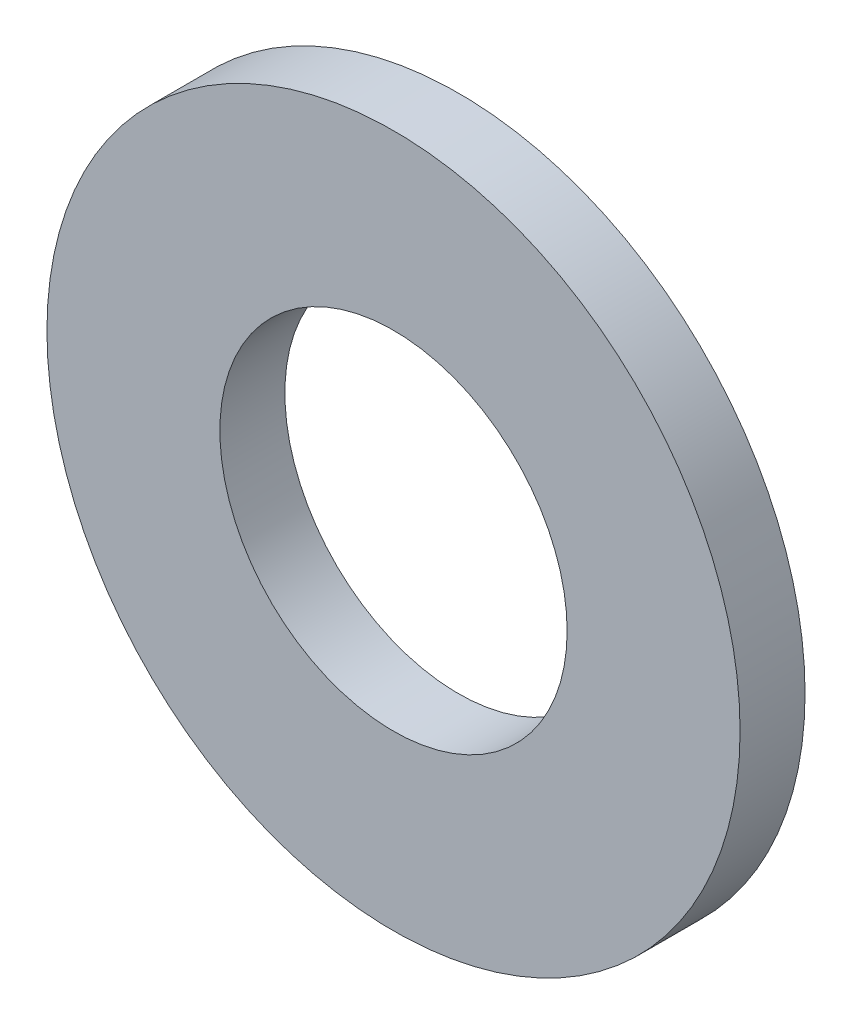
ISO-10303-21;
HEADER;
FILE_DESCRIPTION(('STEP AP214'),'2;1');
FILE_NAME('part.step','',(''),(''),'','','');
FILE_SCHEMA(('AUTOMOTIVE_DESIGN { 1 0 10303 214 1 1 1 1 }'));
ENDSEC;
DATA;
#1=APPLICATION_CONTEXT('core data for automotive mechanical design processes');
#2=APPLICATION_PROTOCOL_DEFINITION('international standard','automotive_design',2000,#1);
#3=PRODUCT_CONTEXT('',#1,'mechanical');
#4=PRODUCT('Part','Part','',(#3));
#5=PRODUCT_RELATED_PRODUCT_CATEGORY('part','',(#4));
#6=PRODUCT_DEFINITION_FORMATION('','',#4);
#7=PRODUCT_DEFINITION_CONTEXT('part definition',#1,'design');
#8=PRODUCT_DEFINITION('design','',#6,#7);
#9=PRODUCT_DEFINITION_SHAPE('','',#8);
#10=(LENGTH_UNIT() NAMED_UNIT(*) SI_UNIT(.MILLI.,.METRE.));
#11=(NAMED_UNIT(*) PLANE_ANGLE_UNIT() SI_UNIT($,.RADIAN.));
#12=(NAMED_UNIT(*) SI_UNIT($,.STERADIAN.) SOLID_ANGLE_UNIT());
#13=UNCERTAINTY_MEASURE_WITH_UNIT(LENGTH_MEASURE(1.E-05),#10,'distance_accuracy_value','');
#14=(GEOMETRIC_REPRESENTATION_CONTEXT(3) GLOBAL_UNCERTAINTY_ASSIGNED_CONTEXT((#13)) GLOBAL_UNIT_ASSIGNED_CONTEXT((#10,
#11,#12)) REPRESENTATION_CONTEXT('',''));
#15=CARTESIAN_POINT('',(0.,0.,0.));
#16=DIRECTION('',(0.,0.,1.));
#17=DIRECTION('',(1.,0.,0.));
#18=AXIS2_PLACEMENT_3D('',#15,#16,#17);
#19=CARTESIAN_POINT('',(0.,0.,1.190625));
#20=DIRECTION('',(0.,0.,1.));
#21=DIRECTION('',(1.,0.,0.));
#22=AXIS2_PLACEMENT_3D('',#19,#20,#21);
#23=PLANE('',#22);
#24=CARTESIAN_POINT('',(0.,0.,1.190625));
#25=DIRECTION('',(0.,0.,1.));
#26=DIRECTION('',(1.,0.,0.));
#27=AXIS2_PLACEMENT_3D('',#24,#25,#26);
#28=CIRCLE('',#27,12.7);
#29=CARTESIAN_POINT('',(12.7,0.,1.190625));
#30=VERTEX_POINT('',#29);
#31=EDGE_CURVE('E10',#30,#30,#28,.T.);
#32=ORIENTED_EDGE('',*,*,#31,.T.);
#33=EDGE_LOOP('',(#32));
#34=FACE_BOUND('',#33,.T.);
#35=CARTESIAN_POINT('',(0.,0.,1.190625));
#36=DIRECTION('',(0.,0.,1.));
#37=DIRECTION('',(1.,0.,0.));
#38=AXIS2_PLACEMENT_3D('',#35,#36,#37);
#39=CIRCLE('',#38,6.3627);
#40=CARTESIAN_POINT('',(6.3627,0.,1.190625));
#41=VERTEX_POINT('',#40);
#42=EDGE_CURVE('E41',#41,#41,#39,.T.);
#43=ORIENTED_EDGE('',*,*,#42,.F.);
#44=EDGE_LOOP('',(#43));
#45=FACE_BOUND('',#44,.T.);
#46=ADVANCED_FACE('F30',(#34,#45),#23,.T.);
#47=CARTESIAN_POINT('',(0.,0.,-1.190625));
#48=DIRECTION('',(0.,0.,1.));
#49=DIRECTION('',(1.,0.,0.));
#50=AXIS2_PLACEMENT_3D('',#47,#48,#49);
#51=PLANE('',#50);
#52=CARTESIAN_POINT('',(0.,0.,-1.190625));
#53=DIRECTION('',(0.,0.,1.));
#54=DIRECTION('',(1.,0.,0.));
#55=AXIS2_PLACEMENT_3D('',#52,#53,#54);
#56=CIRCLE('',#55,12.7);
#57=CARTESIAN_POINT('',(12.7,0.,-1.190625));
#58=VERTEX_POINT('',#57);
#59=EDGE_CURVE('E34',#58,#58,#56,.T.);
#60=ORIENTED_EDGE('',*,*,#59,.F.);
#61=EDGE_LOOP('',(#60));
#62=FACE_BOUND('',#61,.T.);
#63=CARTESIAN_POINT('',(0.,0.,-1.190625));
#64=DIRECTION('',(0.,0.,1.));
#65=DIRECTION('',(1.,0.,0.));
#66=AXIS2_PLACEMENT_3D('',#63,#64,#65);
#67=CIRCLE('',#66,6.3627);
#68=CARTESIAN_POINT('',(6.3627,0.,-1.190625));
#69=VERTEX_POINT('',#68);
#70=EDGE_CURVE('E43',#69,#69,#67,.T.);
#71=ORIENTED_EDGE('',*,*,#70,.T.);
#72=EDGE_LOOP('',(#71));
#73=FACE_BOUND('',#72,.T.);
#74=ADVANCED_FACE('F53',(#62,#73),#51,.F.);
#75=CARTESIAN_POINT('',(0.,0.,1.190625));
#76=DIRECTION('',(0.,0.,-1.));
#77=DIRECTION('',(-1.,0.,0.));
#78=AXIS2_PLACEMENT_3D('',#75,#76,#77);
#79=CYLINDRICAL_SURFACE('',#78,12.7);
#80=ORIENTED_EDGE('',*,*,#31,.F.);
#81=EDGE_LOOP('',(#80));
#82=FACE_BOUND('',#81,.T.);
#83=ORIENTED_EDGE('',*,*,#59,.T.);
#84=EDGE_LOOP('',(#83));
#85=FACE_BOUND('',#84,.T.);
#86=ADVANCED_FACE('F32',(#82,#85),#79,.T.);
#87=CARTESIAN_POINT('',(0.,0.,1.190625));
#88=DIRECTION('',(0.,0.,-1.));
#89=DIRECTION('',(-1.,0.,0.));
#90=AXIS2_PLACEMENT_3D('',#87,#88,#89);
#91=CYLINDRICAL_SURFACE('',#90,6.3627);
#92=ORIENTED_EDGE('',*,*,#42,.T.);
#93=EDGE_LOOP('',(#92));
#94=FACE_BOUND('',#93,.T.);
#95=ORIENTED_EDGE('',*,*,#70,.F.);
#96=EDGE_LOOP('',(#95));
#97=FACE_BOUND('',#96,.T.);
#98=ADVANCED_FACE('F49',(#94,#97),#91,.F.);
#99=CLOSED_SHELL('',(#46,#74,#86,#98));
#100=MANIFOLD_SOLID_BREP('B2',#99);
#101=ADVANCED_BREP_SHAPE_REPRESENTATION('',(#18,#100),#14);
#102=SHAPE_DEFINITION_REPRESENTATION(#9,#101);
ENDSEC;
END-ISO-10303-21;
